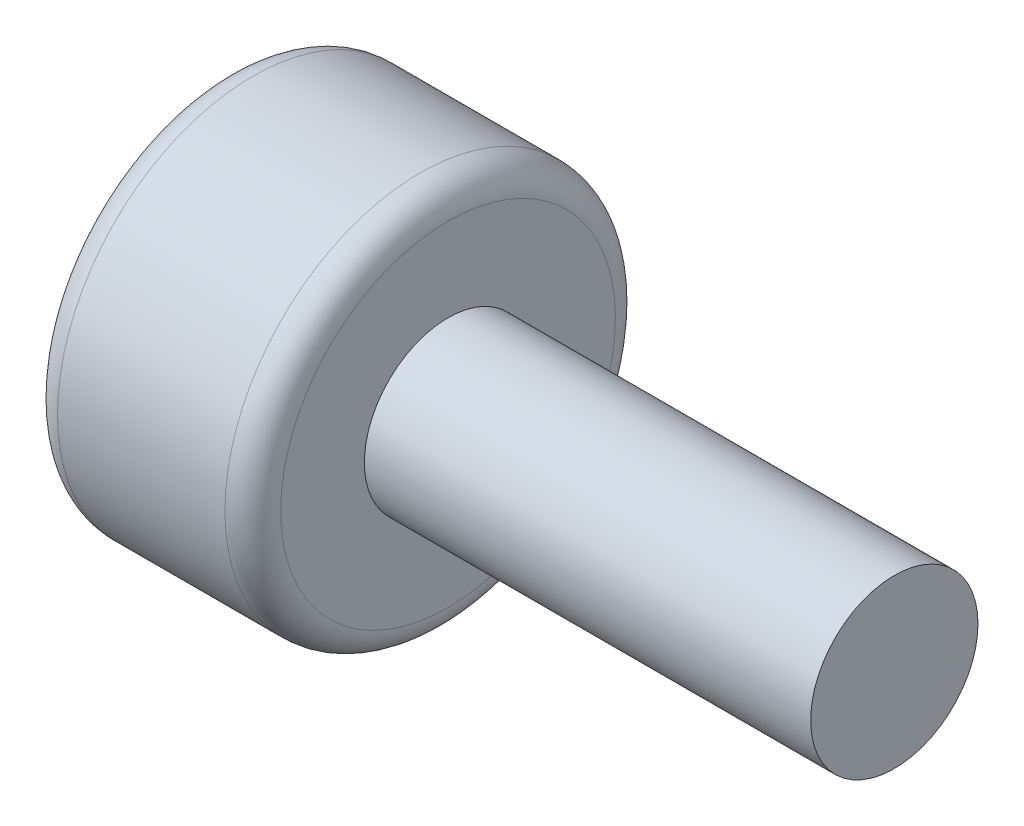
ISO-10303-21;
HEADER;
FILE_DESCRIPTION(('STEP AP214'),'2;1');
FILE_NAME('part.step','',(''),(''),'','','');
FILE_SCHEMA(('AUTOMOTIVE_DESIGN { 1 0 10303 214 1 1 1 1 }'));
ENDSEC;
DATA;
#1=APPLICATION_CONTEXT('core data for automotive mechanical design processes');
#2=APPLICATION_PROTOCOL_DEFINITION('international standard','automotive_design',2000,#1);
#3=PRODUCT_CONTEXT('',#1,'mechanical');
#4=PRODUCT('Part','Part','',(#3));
#5=PRODUCT_RELATED_PRODUCT_CATEGORY('part','',(#4));
#6=PRODUCT_DEFINITION_FORMATION('','',#4);
#7=PRODUCT_DEFINITION_CONTEXT('part definition',#1,'design');
#8=PRODUCT_DEFINITION('design','',#6,#7);
#9=PRODUCT_DEFINITION_SHAPE('','',#8);
#10=(LENGTH_UNIT() NAMED_UNIT(*) SI_UNIT(.MILLI.,.METRE.));
#11=(NAMED_UNIT(*) PLANE_ANGLE_UNIT() SI_UNIT($,.RADIAN.));
#12=(NAMED_UNIT(*) SI_UNIT($,.STERADIAN.) SOLID_ANGLE_UNIT());
#13=UNCERTAINTY_MEASURE_WITH_UNIT(LENGTH_MEASURE(1.E-05),#10,'distance_accuracy_value','');
#14=(GEOMETRIC_REPRESENTATION_CONTEXT(3) GLOBAL_UNCERTAINTY_ASSIGNED_CONTEXT((#13)) GLOBAL_UNIT_ASSIGNED_CONTEXT((#10,
#11,#12)) REPRESENTATION_CONTEXT('',''));
#15=CARTESIAN_POINT('',(0.,0.,0.));
#16=DIRECTION('',(0.,0.,1.));
#17=DIRECTION('',(1.,0.,0.));
#18=AXIS2_PLACEMENT_3D('',#15,#16,#17);
#19=CARTESIAN_POINT('',(4.,0.,0.));
#20=DIRECTION('',(-1.,0.,0.));
#21=DIRECTION('',(0.,0.,1.));
#22=AXIS2_PLACEMENT_3D('',#19,#20,#21);
#23=CYLINDRICAL_SURFACE('',#22,3.5);
#24=CARTESIAN_POINT('',(0.5,0.,0.));
#25=DIRECTION('',(1.,0.,0.));
#26=DIRECTION('',(0.,0.,-1.));
#27=AXIS2_PLACEMENT_3D('',#24,#25,#26);
#28=CIRCLE('',#27,3.5);
#29=CARTESIAN_POINT('',(0.5,0.,-3.5));
#30=VERTEX_POINT('',#29);
#31=EDGE_CURVE('E149',#30,#30,#28,.T.);
#32=ORIENTED_EDGE('',*,*,#31,.T.);
#33=EDGE_LOOP('',(#32));
#34=FACE_BOUND('',#33,.T.);
#35=CARTESIAN_POINT('',(3.5,0.,0.));
#36=DIRECTION('',(1.,0.,0.));
#37=DIRECTION('',(0.,0.,-1.));
#38=AXIS2_PLACEMENT_3D('',#35,#36,#37);
#39=CIRCLE('',#38,3.5);
#40=CARTESIAN_POINT('',(3.5,0.,-3.5));
#41=VERTEX_POINT('',#40);
#42=EDGE_CURVE('E144',#41,#41,#39,.F.);
#43=ORIENTED_EDGE('',*,*,#42,.T.);
#44=EDGE_LOOP('',(#43));
#45=FACE_BOUND('',#44,.T.);
#46=ADVANCED_FACE('F33',(#34,#45),#23,.T.);
#47=CARTESIAN_POINT('',(4.,0.,0.));
#48=DIRECTION('',(1.,0.,0.));
#49=DIRECTION('',(0.,0.,-1.));
#50=AXIS2_PLACEMENT_3D('',#47,#48,#49);
#51=PLANE('',#50);
#52=CARTESIAN_POINT('',(4.,0.,0.));
#53=DIRECTION('',(1.,0.,0.));
#54=DIRECTION('',(0.,0.,-1.));
#55=AXIS2_PLACEMENT_3D('',#52,#53,#54);
#56=CIRCLE('',#55,3.);
#57=CARTESIAN_POINT('',(4.,0.,-3.));
#58=VERTEX_POINT('',#57);
#59=EDGE_CURVE('E11',#58,#58,#56,.T.);
#60=ORIENTED_EDGE('',*,*,#59,.T.);
#61=EDGE_LOOP('',(#60));
#62=FACE_BOUND('',#61,.T.);
#63=CARTESIAN_POINT('',(4.,0.,0.));
#64=DIRECTION('',(1.,0.,0.));
#65=DIRECTION('',(0.,0.,-1.));
#66=AXIS2_PLACEMENT_3D('',#63,#64,#65);
#67=CIRCLE('',#66,1.5);
#68=CARTESIAN_POINT('',(4.,0.,-1.5));
#69=VERTEX_POINT('',#68);
#70=EDGE_CURVE('E135',#69,#69,#67,.T.);
#71=ORIENTED_EDGE('',*,*,#70,.F.);
#72=EDGE_LOOP('',(#71));
#73=FACE_BOUND('',#72,.T.);
#74=ADVANCED_FACE('F164',(#62,#73),#51,.T.);
#75=CARTESIAN_POINT('',(0.,0.,0.));
#76=DIRECTION('',(1.,0.,0.));
#77=DIRECTION('',(0.,0.,-1.));
#78=AXIS2_PLACEMENT_3D('',#75,#76,#77);
#79=PLANE('',#78);
#80=CARTESIAN_POINT('',(0.,0.,0.));
#81=DIRECTION('',(1.,0.,0.));
#82=DIRECTION('',(0.,0.,-1.));
#83=AXIS2_PLACEMENT_3D('',#80,#81,#82);
#84=CIRCLE('',#83,3.);
#85=CARTESIAN_POINT('',(0.,0.,-3.));
#86=VERTEX_POINT('',#85);
#87=EDGE_CURVE('E41',#86,#86,#84,.F.);
#88=ORIENTED_EDGE('',*,*,#87,.T.);
#89=EDGE_LOOP('',(#88));
#90=FACE_BOUND('',#89,.T.);
#91=DIRECTION('',(0.,-0.5,-0.866025403784438));
#92=VECTOR('',#91,1.);
#93=CARTESIAN_POINT('',(0.,1.73205080756888,0.));
#94=LINE('',#93,#92);
#95=CARTESIAN_POINT('',(0.,1.73205080756888,0.));
#96=VERTEX_POINT('',#95);
#97=CARTESIAN_POINT('',(0.,0.866025403784438,-1.5));
#98=VERTEX_POINT('',#97);
#99=EDGE_CURVE('E122',#96,#98,#94,.T.);
#100=ORIENTED_EDGE('',*,*,#99,.F.);
#101=DIRECTION('',(0.,0.5,-0.866025403784439));
#102=VECTOR('',#101,1.);
#103=CARTESIAN_POINT('',(0.,0.866025403784439,1.5));
#104=LINE('',#103,#102);
#105=CARTESIAN_POINT('',(0.,0.866025403784439,1.5));
#106=VERTEX_POINT('',#105);
#107=EDGE_CURVE('E48',#106,#96,#104,.T.);
#108=ORIENTED_EDGE('',*,*,#107,.F.);
#109=DIRECTION('',(0.,1.,0.));
#110=VECTOR('',#109,1.);
#111=CARTESIAN_POINT('',(0.,-0.866025403784438,1.5));
#112=LINE('',#111,#110);
#113=CARTESIAN_POINT('',(0.,-0.866025403784438,1.5));
#114=VERTEX_POINT('',#113);
#115=EDGE_CURVE('E131',#114,#106,#112,.T.);
#116=ORIENTED_EDGE('',*,*,#115,.F.);
#117=DIRECTION('',(0.,0.5,0.866025403784439));
#118=VECTOR('',#117,1.);
#119=CARTESIAN_POINT('',(0.,-1.73205080756888,0.));
#120=LINE('',#119,#118);
#121=CARTESIAN_POINT('',(0.,-1.73205080756888,0.));
#122=VERTEX_POINT('',#121);
#123=EDGE_CURVE('E129',#122,#114,#120,.T.);
#124=ORIENTED_EDGE('',*,*,#123,.F.);
#125=DIRECTION('',(0.,-0.5,0.866025403784439));
#126=VECTOR('',#125,1.);
#127=CARTESIAN_POINT('',(0.,-0.866025403784439,-1.5));
#128=LINE('',#127,#126);
#129=CARTESIAN_POINT('',(0.,-0.866025403784439,-1.5));
#130=VERTEX_POINT('',#129);
#131=EDGE_CURVE('E96',#130,#122,#128,.T.);
#132=ORIENTED_EDGE('',*,*,#131,.F.);
#133=DIRECTION('',(0.,-1.,0.));
#134=VECTOR('',#133,1.);
#135=CARTESIAN_POINT('',(0.,0.866025403784438,-1.5));
#136=LINE('',#135,#134);
#137=EDGE_CURVE('E125',#98,#130,#136,.T.);
#138=ORIENTED_EDGE('',*,*,#137,.F.);
#139=EDGE_LOOP('',(#100,#108,#116,#124,#132,#138));
#140=FACE_BOUND('',#139,.T.);
#141=ADVANCED_FACE('F154',(#90,#140),#79,.F.);
#142=CARTESIAN_POINT('',(12.,0.,0.));
#143=DIRECTION('',(-1.,0.,0.));
#144=DIRECTION('',(0.,0.,1.));
#145=AXIS2_PLACEMENT_3D('',#142,#143,#144);
#146=CYLINDRICAL_SURFACE('',#145,1.5);
#147=CARTESIAN_POINT('',(12.,0.,0.));
#148=DIRECTION('',(1.,0.,0.));
#149=DIRECTION('',(0.,0.,-1.));
#150=AXIS2_PLACEMENT_3D('',#147,#148,#149);
#151=CIRCLE('',#150,1.5);
#152=CARTESIAN_POINT('',(12.,0.,-1.5));
#153=VERTEX_POINT('',#152);
#154=EDGE_CURVE('E141',#153,#153,#151,.T.);
#155=ORIENTED_EDGE('',*,*,#154,.F.);
#156=EDGE_LOOP('',(#155));
#157=FACE_BOUND('',#156,.T.);
#158=ORIENTED_EDGE('',*,*,#70,.T.);
#159=EDGE_LOOP('',(#158));
#160=FACE_BOUND('',#159,.T.);
#161=ADVANCED_FACE('F177',(#157,#160),#146,.T.);
#162=CARTESIAN_POINT('',(12.,0.,0.));
#163=DIRECTION('',(1.,0.,0.));
#164=DIRECTION('',(0.,0.,-1.));
#165=AXIS2_PLACEMENT_3D('',#162,#163,#164);
#166=PLANE('',#165);
#167=ORIENTED_EDGE('',*,*,#154,.T.);
#168=EDGE_LOOP('',(#167));
#169=FACE_BOUND('',#168,.T.);
#170=ADVANCED_FACE('F179',(#169),#166,.T.);
#171=CARTESIAN_POINT('',(2.,0.866025403784439,1.5));
#172=DIRECTION('',(0.,0.866025403784439,0.5));
#173=DIRECTION('',(0.,-0.5,0.866025403784439));
#174=AXIS2_PLACEMENT_3D('',#171,#172,#173);
#175=PLANE('',#174);
#176=ORIENTED_EDGE('',*,*,#107,.T.);
#177=DIRECTION('',(-1.,0.,0.));
#178=VECTOR('',#177,1.);
#179=CARTESIAN_POINT('',(2.,1.73205080756888,0.));
#180=LINE('',#179,#178);
#181=CARTESIAN_POINT('',(2.,1.73205080756888,0.));
#182=VERTEX_POINT('',#181);
#183=EDGE_CURVE('E78',#182,#96,#180,.T.);
#184=ORIENTED_EDGE('',*,*,#183,.F.);
#185=DIRECTION('',(0.,0.5,-0.866025403784439));
#186=VECTOR('',#185,1.);
#187=CARTESIAN_POINT('',(2.,0.866025403784439,1.5));
#188=LINE('',#187,#186);
#189=CARTESIAN_POINT('',(2.,0.866025403784439,1.5));
#190=VERTEX_POINT('',#189);
#191=EDGE_CURVE('E133',#190,#182,#188,.T.);
#192=ORIENTED_EDGE('',*,*,#191,.F.);
#193=DIRECTION('',(-1.,0.,0.));
#194=VECTOR('',#193,1.);
#195=CARTESIAN_POINT('',(2.,0.866025403784439,1.5));
#196=LINE('',#195,#194);
#197=EDGE_CURVE('E56',#190,#106,#196,.T.);
#198=ORIENTED_EDGE('',*,*,#197,.T.);
#199=EDGE_LOOP('',(#176,#184,#192,#198));
#200=FACE_BOUND('',#199,.T.);
#201=ADVANCED_FACE('F186',(#200),#175,.F.);
#202=CARTESIAN_POINT('',(2.,-0.866025403784438,1.5));
#203=DIRECTION('',(0.,0.,1.));
#204=DIRECTION('',(0.,-1.,0.));
#205=AXIS2_PLACEMENT_3D('',#202,#203,#204);
#206=PLANE('',#205);
#207=ORIENTED_EDGE('',*,*,#115,.T.);
#208=ORIENTED_EDGE('',*,*,#197,.F.);
#209=DIRECTION('',(0.,1.,0.));
#210=VECTOR('',#209,1.);
#211=CARTESIAN_POINT('',(2.,-0.866025403784438,1.5));
#212=LINE('',#211,#210);
#213=CARTESIAN_POINT('',(2.,-0.866025403784438,1.5));
#214=VERTEX_POINT('',#213);
#215=EDGE_CURVE('E108',#214,#190,#212,.T.);
#216=ORIENTED_EDGE('',*,*,#215,.F.);
#217=DIRECTION('',(-1.,0.,0.));
#218=VECTOR('',#217,1.);
#219=CARTESIAN_POINT('',(2.,-0.866025403784438,1.5));
#220=LINE('',#219,#218);
#221=EDGE_CURVE('E100',#214,#114,#220,.T.);
#222=ORIENTED_EDGE('',*,*,#221,.T.);
#223=EDGE_LOOP('',(#207,#208,#216,#222));
#224=FACE_BOUND('',#223,.T.);
#225=ADVANCED_FACE('F194',(#224),#206,.F.);
#226=CARTESIAN_POINT('',(2.,-1.73205080756888,0.));
#227=DIRECTION('',(0.,-0.866025403784439,0.5));
#228=DIRECTION('',(0.,-0.5,-0.866025403784439));
#229=AXIS2_PLACEMENT_3D('',#226,#227,#228);
#230=PLANE('',#229);
#231=ORIENTED_EDGE('',*,*,#123,.T.);
#232=ORIENTED_EDGE('',*,*,#221,.F.);
#233=DIRECTION('',(0.,0.5,0.866025403784439));
#234=VECTOR('',#233,1.);
#235=CARTESIAN_POINT('',(2.,-1.73205080756888,0.));
#236=LINE('',#235,#234);
#237=CARTESIAN_POINT('',(2.,-1.73205080756888,0.));
#238=VERTEX_POINT('',#237);
#239=EDGE_CURVE('E104',#238,#214,#236,.T.);
#240=ORIENTED_EDGE('',*,*,#239,.F.);
#241=DIRECTION('',(-1.,0.,0.));
#242=VECTOR('',#241,1.);
#243=CARTESIAN_POINT('',(2.,-1.73205080756888,0.));
#244=LINE('',#243,#242);
#245=EDGE_CURVE('E89',#238,#122,#244,.T.);
#246=ORIENTED_EDGE('',*,*,#245,.T.);
#247=EDGE_LOOP('',(#231,#232,#240,#246));
#248=FACE_BOUND('',#247,.T.);
#249=ADVANCED_FACE('F105',(#248),#230,.F.);
#250=CARTESIAN_POINT('',(2.,-0.866025403784439,-1.5));
#251=DIRECTION('',(0.,-0.866025403784439,-0.5));
#252=DIRECTION('',(0.,0.5,-0.866025403784439));
#253=AXIS2_PLACEMENT_3D('',#250,#251,#252);
#254=PLANE('',#253);
#255=ORIENTED_EDGE('',*,*,#131,.T.);
#256=ORIENTED_EDGE('',*,*,#245,.F.);
#257=DIRECTION('',(0.,-0.5,0.866025403784439));
#258=VECTOR('',#257,1.);
#259=CARTESIAN_POINT('',(2.,-0.866025403784439,-1.5));
#260=LINE('',#259,#258);
#261=CARTESIAN_POINT('',(2.,-0.866025403784439,-1.5));
#262=VERTEX_POINT('',#261);
#263=EDGE_CURVE('E93',#262,#238,#260,.T.);
#264=ORIENTED_EDGE('',*,*,#263,.F.);
#265=DIRECTION('',(-1.,0.,0.));
#266=VECTOR('',#265,1.);
#267=CARTESIAN_POINT('',(2.,-0.866025403784439,-1.5));
#268=LINE('',#267,#266);
#269=EDGE_CURVE('E101',#262,#130,#268,.T.);
#270=ORIENTED_EDGE('',*,*,#269,.T.);
#271=EDGE_LOOP('',(#255,#256,#264,#270));
#272=FACE_BOUND('',#271,.T.);
#273=ADVANCED_FACE('F91',(#272),#254,.F.);
#274=CARTESIAN_POINT('',(2.,0.866025403784438,-1.5));
#275=DIRECTION('',(0.,0.,-1.));
#276=DIRECTION('',(0.,1.,0.));
#277=AXIS2_PLACEMENT_3D('',#274,#275,#276);
#278=PLANE('',#277);
#279=ORIENTED_EDGE('',*,*,#137,.T.);
#280=ORIENTED_EDGE('',*,*,#269,.F.);
#281=DIRECTION('',(0.,-1.,0.));
#282=VECTOR('',#281,1.);
#283=CARTESIAN_POINT('',(2.,0.866025403784438,-1.5));
#284=LINE('',#283,#282);
#285=CARTESIAN_POINT('',(2.,0.866025403784438,-1.5));
#286=VERTEX_POINT('',#285);
#287=EDGE_CURVE('E114',#286,#262,#284,.T.);
#288=ORIENTED_EDGE('',*,*,#287,.F.);
#289=DIRECTION('',(-1.,0.,0.));
#290=VECTOR('',#289,1.);
#291=CARTESIAN_POINT('',(2.,0.866025403784438,-1.5));
#292=LINE('',#291,#290);
#293=EDGE_CURVE('E138',#286,#98,#292,.T.);
#294=ORIENTED_EDGE('',*,*,#293,.T.);
#295=EDGE_LOOP('',(#279,#280,#288,#294));
#296=FACE_BOUND('',#295,.T.);
#297=ADVANCED_FACE('F198',(#296),#278,.F.);
#298=CARTESIAN_POINT('',(2.,1.73205080756888,0.));
#299=DIRECTION('',(0.,0.866025403784439,-0.5));
#300=DIRECTION('',(0.,0.5,0.866025403784438));
#301=AXIS2_PLACEMENT_3D('',#298,#299,#300);
#302=PLANE('',#301);
#303=ORIENTED_EDGE('',*,*,#99,.T.);
#304=ORIENTED_EDGE('',*,*,#293,.F.);
#305=DIRECTION('',(0.,-0.5,-0.866025403784438));
#306=VECTOR('',#305,1.);
#307=CARTESIAN_POINT('',(2.,1.73205080756888,0.));
#308=LINE('',#307,#306);
#309=EDGE_CURVE('E116',#182,#286,#308,.T.);
#310=ORIENTED_EDGE('',*,*,#309,.F.);
#311=ORIENTED_EDGE('',*,*,#183,.T.);
#312=EDGE_LOOP('',(#303,#304,#310,#311));
#313=FACE_BOUND('',#312,.T.);
#314=ADVANCED_FACE('F195',(#313),#302,.F.);
#315=CARTESIAN_POINT('',(2.,0.,0.));
#316=DIRECTION('',(-1.,0.,0.));
#317=DIRECTION('',(0.,0.,1.));
#318=AXIS2_PLACEMENT_3D('',#315,#316,#317);
#319=PLANE('',#318);
#320=ORIENTED_EDGE('',*,*,#191,.T.);
#321=ORIENTED_EDGE('',*,*,#309,.T.);
#322=ORIENTED_EDGE('',*,*,#287,.T.);
#323=ORIENTED_EDGE('',*,*,#263,.T.);
#324=ORIENTED_EDGE('',*,*,#239,.T.);
#325=ORIENTED_EDGE('',*,*,#215,.T.);
#326=EDGE_LOOP('',(#320,#321,#322,#323,#324,#325));
#327=FACE_BOUND('',#326,.T.);
#328=ADVANCED_FACE('F111',(#327),#319,.T.);
#329=CARTESIAN_POINT('',(0.5,0.,0.));
#330=DIRECTION('',(1.,0.,0.));
#331=DIRECTION('',(0.,0.,-1.));
#332=AXIS2_PLACEMENT_3D('',#329,#330,#331);
#333=TOROIDAL_SURFACE('',#332,3.,0.5);
#334=ORIENTED_EDGE('',*,*,#87,.F.);
#335=EDGE_LOOP('',(#334));
#336=FACE_BOUND('',#335,.T.);
#337=ORIENTED_EDGE('',*,*,#31,.F.);
#338=EDGE_LOOP('',(#337));
#339=FACE_BOUND('',#338,.T.);
#340=ADVANCED_FACE('F157',(#336,#339),#333,.T.);
#341=CARTESIAN_POINT('',(3.5,0.,0.));
#342=DIRECTION('',(1.,0.,0.));
#343=DIRECTION('',(0.,0.,-1.));
#344=AXIS2_PLACEMENT_3D('',#341,#342,#343);
#345=TOROIDAL_SURFACE('',#344,3.,0.5);
#346=ORIENTED_EDGE('',*,*,#42,.F.);
#347=EDGE_LOOP('',(#346));
#348=FACE_BOUND('',#347,.T.);
#349=ORIENTED_EDGE('',*,*,#59,.F.);
#350=EDGE_LOOP('',(#349));
#351=FACE_BOUND('',#350,.T.);
#352=ADVANCED_FACE('F35',(#348,#351),#345,.T.);
#353=CLOSED_SHELL('',(#46,#74,#141,#161,#170,#201,#225,#249,#273,#297,#314,#328,#340,#352));
#354=MANIFOLD_SOLID_BREP('B2',#353);
#355=ADVANCED_BREP_SHAPE_REPRESENTATION('',(#18,#354),#14);
#356=SHAPE_DEFINITION_REPRESENTATION(#9,#355);
ENDSEC;
END-ISO-10303-21;
